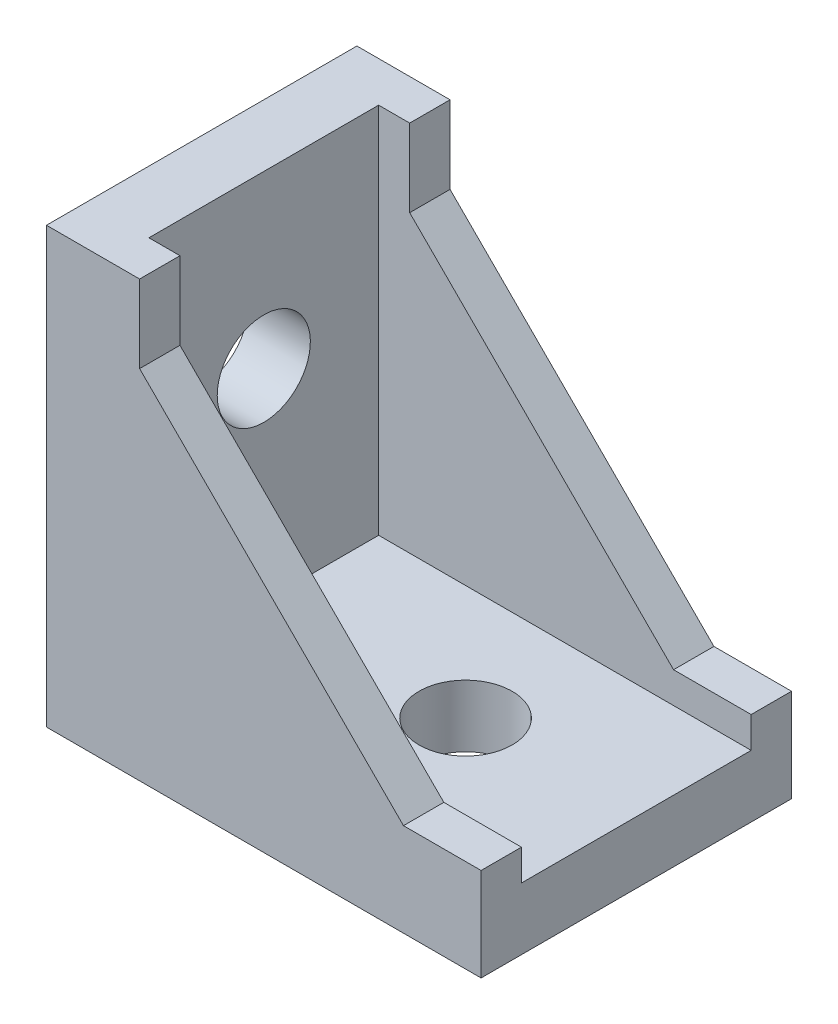
ISO-10303-21;
HEADER;
FILE_DESCRIPTION(('STEP AP214'),'2;1');
FILE_NAME('part.step','',(''),(''),'','','');
FILE_SCHEMA(('AUTOMOTIVE_DESIGN { 1 0 10303 214 1 1 1 1 }'));
ENDSEC;
DATA;
#1=APPLICATION_CONTEXT('core data for automotive mechanical design processes');
#2=APPLICATION_PROTOCOL_DEFINITION('international standard','automotive_design',2000,#1);
#3=PRODUCT_CONTEXT('',#1,'mechanical');
#4=PRODUCT('Part','Part','',(#3));
#5=PRODUCT_RELATED_PRODUCT_CATEGORY('part','',(#4));
#6=PRODUCT_DEFINITION_FORMATION('','',#4);
#7=PRODUCT_DEFINITION_CONTEXT('part definition',#1,'design');
#8=PRODUCT_DEFINITION('design','',#6,#7);
#9=PRODUCT_DEFINITION_SHAPE('','',#8);
#10=(LENGTH_UNIT() NAMED_UNIT(*) SI_UNIT(.MILLI.,.METRE.));
#11=(NAMED_UNIT(*) PLANE_ANGLE_UNIT() SI_UNIT($,.RADIAN.));
#12=(NAMED_UNIT(*) SI_UNIT($,.STERADIAN.) SOLID_ANGLE_UNIT());
#13=UNCERTAINTY_MEASURE_WITH_UNIT(LENGTH_MEASURE(1.E-05),#10,'distance_accuracy_value','');
#14=(GEOMETRIC_REPRESENTATION_CONTEXT(3) GLOBAL_UNCERTAINTY_ASSIGNED_CONTEXT((#13)) GLOBAL_UNIT_ASSIGNED_CONTEXT((#10,
#11,#12)) REPRESENTATION_CONTEXT('',''));
#15=CARTESIAN_POINT('',(0.,0.,0.));
#16=DIRECTION('',(0.,0.,1.));
#17=DIRECTION('',(1.,0.,0.));
#18=AXIS2_PLACEMENT_3D('',#15,#16,#17);
#19=CARTESIAN_POINT('',(0.,0.,20.));
#20=DIRECTION('',(1.,0.,0.));
#21=DIRECTION('',(0.,0.,-1.));
#22=AXIS2_PLACEMENT_3D('',#19,#20,#21);
#23=PLANE('',#22);
#24=CARTESIAN_POINT('',(0.,17.,10.));
#25=DIRECTION('',(-1.,0.,0.));
#26=DIRECTION('',(0.,0.,1.));
#27=AXIS2_PLACEMENT_3D('',#24,#25,#26);
#28=CIRCLE('',#27,3.);
#29=CARTESIAN_POINT('',(0.,17.,13.));
#30=VERTEX_POINT('',#29);
#31=EDGE_CURVE('E780',#30,#30,#28,.T.);
#32=ORIENTED_EDGE('',*,*,#31,.F.);
#33=EDGE_LOOP('',(#32));
#34=FACE_BOUND('',#33,.T.);
#35=DIRECTION('',(0.,-1.,0.));
#36=VECTOR('',#35,1.);
#37=CARTESIAN_POINT('',(0.,26.,7.));
#38=LINE('',#37,#36);
#39=CARTESIAN_POINT('',(0.,26.,7.));
#40=VERTEX_POINT('',#39);
#41=CARTESIAN_POINT('',(0.,24.,7.));
#42=VERTEX_POINT('',#41);
#43=EDGE_CURVE('E336',#40,#42,#38,.T.);
#44=ORIENTED_EDGE('',*,*,#43,.F.);
#45=DIRECTION('',(0.,0.,-1.));
#46=VECTOR('',#45,1.);
#47=CARTESIAN_POINT('',(0.,26.,13.));
#48=LINE('',#47,#46);
#49=CARTESIAN_POINT('',(0.,26.,13.));
#50=VERTEX_POINT('',#49);
#51=EDGE_CURVE('E341',#50,#40,#48,.T.);
#52=ORIENTED_EDGE('',*,*,#51,.F.);
#53=DIRECTION('',(0.,1.,0.));
#54=VECTOR('',#53,1.);
#55=CARTESIAN_POINT('',(0.,26.,13.));
#56=LINE('',#55,#54);
#57=CARTESIAN_POINT('',(0.,24.,13.));
#58=VERTEX_POINT('',#57);
#59=EDGE_CURVE('E353',#58,#50,#56,.T.);
#60=ORIENTED_EDGE('',*,*,#59,.F.);
#61=DIRECTION('',(0.,0.,1.));
#62=VECTOR('',#61,1.);
#63=CARTESIAN_POINT('',(0.,24.,13.));
#64=LINE('',#63,#62);
#65=EDGE_CURVE('E350',#42,#58,#64,.T.);
#66=ORIENTED_EDGE('',*,*,#65,.F.);
#67=EDGE_LOOP('',(#44,#52,#60,#66));
#68=FACE_BOUND('',#67,.T.);
#69=DIRECTION('',(0.,-1.,0.));
#70=VECTOR('',#69,1.);
#71=CARTESIAN_POINT('',(0.,0.,0.));
#72=LINE('',#71,#70);
#73=CARTESIAN_POINT('',(0.,28.,0.));
#74=VERTEX_POINT('',#73);
#75=CARTESIAN_POINT('',(0.,0.,0.));
#76=VERTEX_POINT('',#75);
#77=EDGE_CURVE('E450',#74,#76,#72,.T.);
#78=ORIENTED_EDGE('',*,*,#77,.T.);
#79=DIRECTION('',(0.,0.,-1.));
#80=VECTOR('',#79,1.);
#81=CARTESIAN_POINT('',(0.,0.,20.));
#82=LINE('',#81,#80);
#83=CARTESIAN_POINT('',(0.,0.,20.));
#84=VERTEX_POINT('',#83);
#85=EDGE_CURVE('E456',#84,#76,#82,.T.);
#86=ORIENTED_EDGE('',*,*,#85,.F.);
#87=DIRECTION('',(0.,-1.,0.));
#88=VECTOR('',#87,1.);
#89=CARTESIAN_POINT('',(0.,0.,20.));
#90=LINE('',#89,#88);
#91=CARTESIAN_POINT('',(0.,28.,20.));
#92=VERTEX_POINT('',#91);
#93=EDGE_CURVE('E454',#92,#84,#90,.T.);
#94=ORIENTED_EDGE('',*,*,#93,.F.);
#95=DIRECTION('',(0.,0.,-1.));
#96=VECTOR('',#95,1.);
#97=CARTESIAN_POINT('',(0.,28.,20.));
#98=LINE('',#97,#96);
#99=EDGE_CURVE('E466',#92,#74,#98,.T.);
#100=ORIENTED_EDGE('',*,*,#99,.T.);
#101=EDGE_LOOP('',(#78,#86,#94,#100));
#102=FACE_BOUND('',#101,.T.);
#103=DIRECTION('',(0.,0.,1.));
#104=VECTOR('',#103,1.);
#105=CARTESIAN_POINT('',(0.,2.,13.));
#106=LINE('',#105,#104);
#107=CARTESIAN_POINT('',(0.,2.,7.));
#108=VERTEX_POINT('',#107);
#109=CARTESIAN_POINT('',(0.,2.,13.));
#110=VERTEX_POINT('',#109);
#111=EDGE_CURVE('E303',#108,#110,#106,.T.);
#112=ORIENTED_EDGE('',*,*,#111,.F.);
#113=DIRECTION('',(0.,-1.,0.));
#114=VECTOR('',#113,1.);
#115=CARTESIAN_POINT('',(0.,2.,7.));
#116=LINE('',#115,#114);
#117=CARTESIAN_POINT('',(0.,4.,7.));
#118=VERTEX_POINT('',#117);
#119=EDGE_CURVE('E308',#118,#108,#116,.T.);
#120=ORIENTED_EDGE('',*,*,#119,.F.);
#121=DIRECTION('',(0.,0.,-1.));
#122=VECTOR('',#121,1.);
#123=CARTESIAN_POINT('',(0.,4.,13.));
#124=LINE('',#123,#122);
#125=CARTESIAN_POINT('',(0.,4.,13.));
#126=VERTEX_POINT('',#125);
#127=EDGE_CURVE('E320',#126,#118,#124,.T.);
#128=ORIENTED_EDGE('',*,*,#127,.F.);
#129=DIRECTION('',(0.,1.,0.));
#130=VECTOR('',#129,1.);
#131=CARTESIAN_POINT('',(0.,2.,13.));
#132=LINE('',#131,#130);
#133=EDGE_CURVE('E317',#110,#126,#132,.T.);
#134=ORIENTED_EDGE('',*,*,#133,.F.);
#135=EDGE_LOOP('',(#112,#120,#128,#134));
#136=FACE_BOUND('',#135,.T.);
#137=ADVANCED_FACE('F34',(#34,#68,#102,#136),#23,.F.);
#138=CARTESIAN_POINT('',(28.,4.00000000000012,20.));
#139=DIRECTION('',(0.,-1.,0.));
#140=DIRECTION('',(1.,0.,0.));
#141=AXIS2_PLACEMENT_3D('',#138,#139,#140);
#142=PLANE('',#141);
#143=CARTESIAN_POINT('',(17.,4.00000000000007,10.));
#144=DIRECTION('',(0.,-1.,0.));
#145=DIRECTION('',(1.,0.,0.));
#146=AXIS2_PLACEMENT_3D('',#143,#144,#145);
#147=CIRCLE('',#146,3.);
#148=CARTESIAN_POINT('',(20.,4.00000000000009,10.));
#149=VERTEX_POINT('',#148);
#150=EDGE_CURVE('E778',#149,#149,#147,.T.);
#151=ORIENTED_EDGE('',*,*,#150,.T.);
#152=EDGE_LOOP('',(#151));
#153=FACE_BOUND('',#152,.T.);
#154=DIRECTION('',(1.,0.,0.));
#155=VECTOR('',#154,1.);
#156=CARTESIAN_POINT('',(4.,4.00000000000002,2.6));
#157=LINE('',#156,#155);
#158=CARTESIAN_POINT('',(4.,4.00000000000002,2.6));
#159=VERTEX_POINT('',#158);
#160=CARTESIAN_POINT('',(28.,4.00000000000012,2.6));
#161=VERTEX_POINT('',#160);
#162=EDGE_CURVE('E385',#159,#161,#157,.T.);
#163=ORIENTED_EDGE('',*,*,#162,.F.);
#164=DIRECTION('',(0.,0.,-1.));
#165=VECTOR('',#164,1.);
#166=CARTESIAN_POINT('',(4.,4.00000000000002,20.));
#167=LINE('',#166,#165);
#168=CARTESIAN_POINT('',(4.,4.00000000000002,17.4));
#169=VERTEX_POINT('',#168);
#170=EDGE_CURVE('E472',#169,#159,#167,.T.);
#171=ORIENTED_EDGE('',*,*,#170,.F.);
#172=DIRECTION('',(1.,0.,0.));
#173=VECTOR('',#172,1.);
#174=CARTESIAN_POINT('',(4.,4.00000000000002,17.4));
#175=LINE('',#174,#173);
#176=CARTESIAN_POINT('',(28.,4.00000000000012,17.4));
#177=VERTEX_POINT('',#176);
#178=EDGE_CURVE('E409',#169,#177,#175,.T.);
#179=ORIENTED_EDGE('',*,*,#178,.T.);
#180=DIRECTION('',(0.,0.,-1.));
#181=VECTOR('',#180,1.);
#182=CARTESIAN_POINT('',(28.,4.00000000000012,20.));
#183=LINE('',#182,#181);
#184=EDGE_CURVE('E42',#177,#161,#183,.T.);
#185=ORIENTED_EDGE('',*,*,#184,.T.);
#186=EDGE_LOOP('',(#163,#171,#179,#185));
#187=FACE_BOUND('',#186,.T.);
#188=ADVANCED_FACE('F476',(#153,#187),#142,.F.);
#189=CARTESIAN_POINT('',(4.,28.,20.));
#190=DIRECTION('',(-1.,0.,0.));
#191=DIRECTION('',(0.,-1.,0.));
#192=AXIS2_PLACEMENT_3D('',#189,#190,#191);
#193=PLANE('',#192);
#194=CARTESIAN_POINT('',(4.,17.,10.));
#195=DIRECTION('',(-1.,0.,0.));
#196=DIRECTION('',(0.,-1.,0.));
#197=AXIS2_PLACEMENT_3D('',#194,#195,#196);
#198=CIRCLE('',#197,3.);
#199=CARTESIAN_POINT('',(4.,14.,10.));
#200=VERTEX_POINT('',#199);
#201=EDGE_CURVE('E265',#200,#200,#198,.F.);
#202=ORIENTED_EDGE('',*,*,#201,.F.);
#203=EDGE_LOOP('',(#202));
#204=FACE_BOUND('',#203,.T.);
#205=DIRECTION('',(0.,-1.,0.));
#206=VECTOR('',#205,1.);
#207=CARTESIAN_POINT('',(4.,28.,2.6));
#208=LINE('',#207,#206);
#209=CARTESIAN_POINT('',(4.,28.,2.6));
#210=VERTEX_POINT('',#209);
#211=EDGE_CURVE('E370',#210,#159,#208,.T.);
#212=ORIENTED_EDGE('',*,*,#211,.F.);
#213=DIRECTION('',(0.,0.,-1.));
#214=VECTOR('',#213,1.);
#215=CARTESIAN_POINT('',(4.,28.,20.));
#216=LINE('',#215,#214);
#217=CARTESIAN_POINT('',(4.,28.,17.4));
#218=VERTEX_POINT('',#217);
#219=EDGE_CURVE('E469',#218,#210,#216,.T.);
#220=ORIENTED_EDGE('',*,*,#219,.F.);
#221=DIRECTION('',(0.,-1.,0.));
#222=VECTOR('',#221,1.);
#223=CARTESIAN_POINT('',(4.,28.,17.4));
#224=LINE('',#223,#222);
#225=EDGE_CURVE('E406',#218,#169,#224,.T.);
#226=ORIENTED_EDGE('',*,*,#225,.T.);
#227=ORIENTED_EDGE('',*,*,#170,.T.);
#228=EDGE_LOOP('',(#212,#220,#226,#227));
#229=FACE_BOUND('',#228,.T.);
#230=ADVANCED_FACE('F505',(#204,#229),#193,.F.);
#231=CARTESIAN_POINT('',(0.,0.,20.));
#232=DIRECTION('',(0.,1.,0.));
#233=DIRECTION('',(-1.,0.,0.));
#234=AXIS2_PLACEMENT_3D('',#231,#232,#233);
#235=PLANE('',#234);
#236=CARTESIAN_POINT('',(17.,0.,10.));
#237=DIRECTION('',(0.,1.,0.));
#238=DIRECTION('',(0.,0.,1.));
#239=AXIS2_PLACEMENT_3D('',#236,#237,#238);
#240=CIRCLE('',#239,3.);
#241=CARTESIAN_POINT('',(17.,0.,13.));
#242=VERTEX_POINT('',#241);
#243=EDGE_CURVE('E620',#242,#242,#240,.T.);
#244=ORIENTED_EDGE('',*,*,#243,.T.);
#245=EDGE_LOOP('',(#244));
#246=FACE_BOUND('',#245,.T.);
#247=DIRECTION('',(-1.,0.,0.));
#248=VECTOR('',#247,1.);
#249=CARTESIAN_POINT('',(2.,0.,7.));
#250=LINE('',#249,#248);
#251=CARTESIAN_POINT('',(4.,0.,7.));
#252=VERTEX_POINT('',#251);
#253=CARTESIAN_POINT('',(2.,0.,7.));
#254=VERTEX_POINT('',#253);
#255=EDGE_CURVE('E264',#252,#254,#250,.T.);
#256=ORIENTED_EDGE('',*,*,#255,.T.);
#257=DIRECTION('',(0.,0.,1.));
#258=VECTOR('',#257,1.);
#259=CARTESIAN_POINT('',(2.,0.,13.));
#260=LINE('',#259,#258);
#261=CARTESIAN_POINT('',(2.,0.,13.));
#262=VERTEX_POINT('',#261);
#263=EDGE_CURVE('E237',#254,#262,#260,.T.);
#264=ORIENTED_EDGE('',*,*,#263,.T.);
#265=DIRECTION('',(1.,0.,0.));
#266=VECTOR('',#265,1.);
#267=CARTESIAN_POINT('',(2.,0.,13.));
#268=LINE('',#267,#266);
#269=CARTESIAN_POINT('',(4.00000000000001,0.,13.));
#270=VERTEX_POINT('',#269);
#271=EDGE_CURVE('E253',#262,#270,#268,.T.);
#272=ORIENTED_EDGE('',*,*,#271,.T.);
#273=DIRECTION('',(0.,0.,-1.));
#274=VECTOR('',#273,1.);
#275=CARTESIAN_POINT('',(4.,0.,13.));
#276=LINE('',#275,#274);
#277=EDGE_CURVE('E49',#270,#252,#276,.T.);
#278=ORIENTED_EDGE('',*,*,#277,.T.);
#279=EDGE_LOOP('',(#256,#264,#272,#278));
#280=FACE_BOUND('',#279,.T.);
#281=DIRECTION('',(0.,0.,-1.));
#282=VECTOR('',#281,1.);
#283=CARTESIAN_POINT('',(26.,1.09690034832965E-13,13.));
#284=LINE('',#283,#282);
#285=CARTESIAN_POINT('',(26.,1.09690034832965E-13,13.));
#286=VERTEX_POINT('',#285);
#287=CARTESIAN_POINT('',(26.,1.09690034832965E-13,7.));
#288=VERTEX_POINT('',#287);
#289=EDGE_CURVE('E290',#286,#288,#284,.T.);
#290=ORIENTED_EDGE('',*,*,#289,.T.);
#291=DIRECTION('',(-1.,0.,0.));
#292=VECTOR('',#291,1.);
#293=CARTESIAN_POINT('',(26.,1.09690034832965E-13,7.));
#294=LINE('',#293,#292);
#295=CARTESIAN_POINT('',(24.,1.01252339845814E-13,7.));
#296=VERTEX_POINT('',#295);
#297=EDGE_CURVE('E242',#288,#296,#294,.T.);
#298=ORIENTED_EDGE('',*,*,#297,.T.);
#299=DIRECTION('',(0.,0.,1.));
#300=VECTOR('',#299,1.);
#301=CARTESIAN_POINT('',(24.,1.01252339845814E-13,13.));
#302=LINE('',#301,#300);
#303=CARTESIAN_POINT('',(24.,1.01109596885505E-13,13.));
#304=VERTEX_POINT('',#303);
#305=EDGE_CURVE('E278',#296,#304,#302,.T.);
#306=ORIENTED_EDGE('',*,*,#305,.T.);
#307=DIRECTION('',(1.,0.,0.));
#308=VECTOR('',#307,1.);
#309=CARTESIAN_POINT('',(26.,1.09690034832965E-13,13.));
#310=LINE('',#309,#308);
#311=EDGE_CURVE('E57',#304,#286,#310,.T.);
#312=ORIENTED_EDGE('',*,*,#311,.T.);
#313=EDGE_LOOP('',(#290,#298,#306,#312));
#314=FACE_BOUND('',#313,.T.);
#315=DIRECTION('',(1.,0.,0.));
#316=VECTOR('',#315,1.);
#317=CARTESIAN_POINT('',(0.,0.,0.));
#318=LINE('',#317,#316);
#319=CARTESIAN_POINT('',(28.,1.17961196366423E-13,0.));
#320=VERTEX_POINT('',#319);
#321=EDGE_CURVE('E439',#76,#320,#318,.T.);
#322=ORIENTED_EDGE('',*,*,#321,.T.);
#323=DIRECTION('',(0.,0.,-1.));
#324=VECTOR('',#323,1.);
#325=CARTESIAN_POINT('',(28.,1.17961196366423E-13,20.));
#326=LINE('',#325,#324);
#327=CARTESIAN_POINT('',(28.,1.17961196366423E-13,20.));
#328=VERTEX_POINT('',#327);
#329=EDGE_CURVE('E11',#328,#320,#326,.T.);
#330=ORIENTED_EDGE('',*,*,#329,.F.);
#331=DIRECTION('',(1.,0.,0.));
#332=VECTOR('',#331,1.);
#333=CARTESIAN_POINT('',(0.,0.,20.));
#334=LINE('',#333,#332);
#335=EDGE_CURVE('E446',#84,#328,#334,.T.);
#336=ORIENTED_EDGE('',*,*,#335,.F.);
#337=ORIENTED_EDGE('',*,*,#85,.T.);
#338=EDGE_LOOP('',(#322,#330,#336,#337));
#339=FACE_BOUND('',#338,.T.);
#340=ADVANCED_FACE('F36',(#246,#280,#314,#339),#235,.F.);
#341=CARTESIAN_POINT('',(28.,1.17961196366423E-13,20.));
#342=DIRECTION('',(-1.,0.,0.));
#343=DIRECTION('',(0.,-1.,0.));
#344=AXIS2_PLACEMENT_3D('',#341,#342,#343);
#345=PLANE('',#344);
#346=DIRECTION('',(0.,1.,0.));
#347=VECTOR('',#346,1.);
#348=CARTESIAN_POINT('',(28.,1.17961196366423E-13,0.));
#349=LINE('',#348,#347);
#350=CARTESIAN_POINT('',(28.,6.00000000000012,0.));
#351=VERTEX_POINT('',#350);
#352=EDGE_CURVE('E459',#320,#351,#349,.T.);
#353=ORIENTED_EDGE('',*,*,#352,.T.);
#354=DIRECTION('',(0.,0.,-1.));
#355=VECTOR('',#354,1.);
#356=CARTESIAN_POINT('',(28.,6.00000000000012,2.6));
#357=LINE('',#356,#355);
#358=CARTESIAN_POINT('',(28.,6.00000000000012,2.6));
#359=VERTEX_POINT('',#358);
#360=EDGE_CURVE('E394',#359,#351,#357,.T.);
#361=ORIENTED_EDGE('',*,*,#360,.F.);
#362=DIRECTION('',(0.,1.,0.));
#363=VECTOR('',#362,1.);
#364=CARTESIAN_POINT('',(28.,4.00000000000012,2.6));
#365=LINE('',#364,#363);
#366=EDGE_CURVE('E383',#161,#359,#365,.T.);
#367=ORIENTED_EDGE('',*,*,#366,.F.);
#368=ORIENTED_EDGE('',*,*,#184,.F.);
#369=DIRECTION('',(0.,1.,0.));
#370=VECTOR('',#369,1.);
#371=CARTESIAN_POINT('',(28.,4.00000000000012,17.4));
#372=LINE('',#371,#370);
#373=CARTESIAN_POINT('',(28.,6.00000000000012,17.4));
#374=VERTEX_POINT('',#373);
#375=EDGE_CURVE('E413',#177,#374,#372,.T.);
#376=ORIENTED_EDGE('',*,*,#375,.T.);
#377=DIRECTION('',(0.,0.,1.));
#378=VECTOR('',#377,1.);
#379=CARTESIAN_POINT('',(28.,6.00000000000012,17.4));
#380=LINE('',#379,#378);
#381=CARTESIAN_POINT('',(28.,6.00000000000012,20.));
#382=VERTEX_POINT('',#381);
#383=EDGE_CURVE('E428',#374,#382,#380,.T.);
#384=ORIENTED_EDGE('',*,*,#383,.T.);
#385=DIRECTION('',(0.,1.,0.));
#386=VECTOR('',#385,1.);
#387=CARTESIAN_POINT('',(28.,1.17961196366423E-13,20.));
#388=LINE('',#387,#386);
#389=EDGE_CURVE('E449',#328,#382,#388,.T.);
#390=ORIENTED_EDGE('',*,*,#389,.F.);
#391=ORIENTED_EDGE('',*,*,#329,.T.);
#392=EDGE_LOOP('',(#353,#361,#367,#368,#376,#384,#390,#391));
#393=FACE_BOUND('',#392,.T.);
#394=ADVANCED_FACE('F483',(#393),#345,.F.);
#395=CARTESIAN_POINT('',(0.,28.,20.));
#396=DIRECTION('',(0.,-1.,0.));
#397=DIRECTION('',(0.,0.,-1.));
#398=AXIS2_PLACEMENT_3D('',#395,#396,#397);
#399=PLANE('',#398);
#400=DIRECTION('',(-1.,0.,0.));
#401=VECTOR('',#400,1.);
#402=CARTESIAN_POINT('',(0.,28.,0.));
#403=LINE('',#402,#401);
#404=CARTESIAN_POINT('',(6.,28.,0.));
#405=VERTEX_POINT('',#404);
#406=EDGE_CURVE('E461',#405,#74,#403,.T.);
#407=ORIENTED_EDGE('',*,*,#406,.T.);
#408=ORIENTED_EDGE('',*,*,#99,.F.);
#409=DIRECTION('',(-1.,0.,0.));
#410=VECTOR('',#409,1.);
#411=CARTESIAN_POINT('',(0.,28.,20.));
#412=LINE('',#411,#410);
#413=CARTESIAN_POINT('',(6.,28.,20.));
#414=VERTEX_POINT('',#413);
#415=EDGE_CURVE('E452',#414,#92,#412,.T.);
#416=ORIENTED_EDGE('',*,*,#415,.F.);
#417=DIRECTION('',(0.,0.,1.));
#418=VECTOR('',#417,1.);
#419=CARTESIAN_POINT('',(6.,28.,17.4));
#420=LINE('',#419,#418);
#421=CARTESIAN_POINT('',(6.,28.,17.4));
#422=VERTEX_POINT('',#421);
#423=EDGE_CURVE('E436',#422,#414,#420,.T.);
#424=ORIENTED_EDGE('',*,*,#423,.F.);
#425=DIRECTION('',(-1.,0.,0.));
#426=VECTOR('',#425,1.);
#427=CARTESIAN_POINT('',(4.,28.,17.4));
#428=LINE('',#427,#426);
#429=EDGE_CURVE('E425',#422,#218,#428,.T.);
#430=ORIENTED_EDGE('',*,*,#429,.T.);
#431=ORIENTED_EDGE('',*,*,#219,.T.);
#432=DIRECTION('',(-1.,0.,0.));
#433=VECTOR('',#432,1.);
#434=CARTESIAN_POINT('',(4.,28.,2.6));
#435=LINE('',#434,#433);
#436=CARTESIAN_POINT('',(6.,28.,2.6));
#437=VERTEX_POINT('',#436);
#438=EDGE_CURVE('E373',#437,#210,#435,.T.);
#439=ORIENTED_EDGE('',*,*,#438,.F.);
#440=DIRECTION('',(0.,0.,-1.));
#441=VECTOR('',#440,1.);
#442=CARTESIAN_POINT('',(6.,28.,2.6));
#443=LINE('',#442,#441);
#444=EDGE_CURVE('E388',#437,#405,#443,.T.);
#445=ORIENTED_EDGE('',*,*,#444,.T.);
#446=EDGE_LOOP('',(#407,#408,#416,#424,#430,#431,#439,#445));
#447=FACE_BOUND('',#446,.T.);
#448=ADVANCED_FACE('F501',(#447),#399,.F.);
#449=CARTESIAN_POINT('',(0.,0.,20.));
#450=DIRECTION('',(0.,0.,1.));
#451=DIRECTION('',(1.,0.,0.));
#452=AXIS2_PLACEMENT_3D('',#449,#450,#451);
#453=PLANE('',#452);
#454=DIRECTION('',(0.,1.,0.));
#455=VECTOR('',#454,1.);
#456=CARTESIAN_POINT('',(6.,28.,20.));
#457=LINE('',#456,#455);
#458=CARTESIAN_POINT('',(6.,23.,20.));
#459=VERTEX_POINT('',#458);
#460=EDGE_CURVE('E410',#459,#414,#457,.T.);
#461=ORIENTED_EDGE('',*,*,#460,.T.);
#462=ORIENTED_EDGE('',*,*,#415,.T.);
#463=ORIENTED_EDGE('',*,*,#93,.T.);
#464=ORIENTED_EDGE('',*,*,#335,.T.);
#465=ORIENTED_EDGE('',*,*,#389,.T.);
#466=DIRECTION('',(-1.,0.,0.));
#467=VECTOR('',#466,1.);
#468=CARTESIAN_POINT('',(28.,6.00000000000012,20.));
#469=LINE('',#468,#467);
#470=CARTESIAN_POINT('',(23.,6.00000000000012,20.));
#471=VERTEX_POINT('',#470);
#472=EDGE_CURVE('E397',#382,#471,#469,.T.);
#473=ORIENTED_EDGE('',*,*,#472,.T.);
#474=DIRECTION('',(-0.707106781186549,0.707106781186546,0.));
#475=VECTOR('',#474,1.);
#476=CARTESIAN_POINT('',(6.,23.,20.));
#477=LINE('',#476,#475);
#478=EDGE_CURVE('E431',#471,#459,#477,.T.);
#479=ORIENTED_EDGE('',*,*,#478,.T.);
#480=EDGE_LOOP('',(#461,#462,#463,#464,#465,#473,#479));
#481=FACE_BOUND('',#480,.T.);
#482=ADVANCED_FACE('F516',(#481),#453,.T.);
#483=CARTESIAN_POINT('',(0.,0.,0.));
#484=DIRECTION('',(0.,0.,1.));
#485=DIRECTION('',(1.,0.,0.));
#486=AXIS2_PLACEMENT_3D('',#483,#484,#485);
#487=PLANE('',#486);
#488=ORIENTED_EDGE('',*,*,#406,.F.);
#489=DIRECTION('',(0.,1.,0.));
#490=VECTOR('',#489,1.);
#491=CARTESIAN_POINT('',(6.,28.,0.));
#492=LINE('',#491,#490);
#493=CARTESIAN_POINT('',(6.,23.,0.));
#494=VERTEX_POINT('',#493);
#495=EDGE_CURVE('E369',#494,#405,#492,.T.);
#496=ORIENTED_EDGE('',*,*,#495,.F.);
#497=DIRECTION('',(-0.707106781186549,0.707106781186546,0.));
#498=VECTOR('',#497,1.);
#499=CARTESIAN_POINT('',(6.,23.,0.));
#500=LINE('',#499,#498);
#501=CARTESIAN_POINT('',(23.,6.00000000000012,0.));
#502=VERTEX_POINT('',#501);
#503=EDGE_CURVE('E391',#502,#494,#500,.T.);
#504=ORIENTED_EDGE('',*,*,#503,.F.);
#505=DIRECTION('',(-1.,0.,0.));
#506=VECTOR('',#505,1.);
#507=CARTESIAN_POINT('',(28.,6.00000000000012,0.));
#508=LINE('',#507,#506);
#509=EDGE_CURVE('E374',#351,#502,#508,.T.);
#510=ORIENTED_EDGE('',*,*,#509,.F.);
#511=ORIENTED_EDGE('',*,*,#352,.F.);
#512=ORIENTED_EDGE('',*,*,#321,.F.);
#513=ORIENTED_EDGE('',*,*,#77,.F.);
#514=EDGE_LOOP('',(#488,#496,#504,#510,#511,#512,#513));
#515=FACE_BOUND('',#514,.T.);
#516=ADVANCED_FACE('F525',(#515),#487,.F.);
#517=CARTESIAN_POINT('',(6.,28.,17.4));
#518=DIRECTION('',(1.,0.,0.));
#519=DIRECTION('',(0.,1.,0.));
#520=AXIS2_PLACEMENT_3D('',#517,#518,#519);
#521=PLANE('',#520);
#522=ORIENTED_EDGE('',*,*,#460,.F.);
#523=DIRECTION('',(0.,0.,1.));
#524=VECTOR('',#523,1.);
#525=CARTESIAN_POINT('',(6.,23.,17.4));
#526=LINE('',#525,#524);
#527=CARTESIAN_POINT('',(6.,23.,17.4));
#528=VERTEX_POINT('',#527);
#529=EDGE_CURVE('E440',#528,#459,#526,.T.);
#530=ORIENTED_EDGE('',*,*,#529,.F.);
#531=DIRECTION('',(0.,1.,0.));
#532=VECTOR('',#531,1.);
#533=CARTESIAN_POINT('',(6.,28.,17.4));
#534=LINE('',#533,#532);
#535=EDGE_CURVE('E422',#528,#422,#534,.T.);
#536=ORIENTED_EDGE('',*,*,#535,.T.);
#537=ORIENTED_EDGE('',*,*,#423,.T.);
#538=EDGE_LOOP('',(#522,#530,#536,#537));
#539=FACE_BOUND('',#538,.T.);
#540=ADVANCED_FACE('F589',(#539),#521,.T.);
#541=CARTESIAN_POINT('',(6.,23.,17.4));
#542=DIRECTION('',(0.707106781186546,0.707106781186549,0.));
#543=DIRECTION('',(-0.707106781186549,0.707106781186546,0.));
#544=AXIS2_PLACEMENT_3D('',#541,#542,#543);
#545=PLANE('',#544);
#546=ORIENTED_EDGE('',*,*,#478,.F.);
#547=DIRECTION('',(0.,0.,1.));
#548=VECTOR('',#547,1.);
#549=CARTESIAN_POINT('',(23.,6.00000000000012,17.4));
#550=LINE('',#549,#548);
#551=CARTESIAN_POINT('',(23.,6.00000000000012,17.4));
#552=VERTEX_POINT('',#551);
#553=EDGE_CURVE('E442',#552,#471,#550,.T.);
#554=ORIENTED_EDGE('',*,*,#553,.F.);
#555=DIRECTION('',(-0.707106781186549,0.707106781186546,0.));
#556=VECTOR('',#555,1.);
#557=CARTESIAN_POINT('',(6.,23.,17.4));
#558=LINE('',#557,#556);
#559=EDGE_CURVE('E419',#552,#528,#558,.T.);
#560=ORIENTED_EDGE('',*,*,#559,.T.);
#561=ORIENTED_EDGE('',*,*,#529,.T.);
#562=EDGE_LOOP('',(#546,#554,#560,#561));
#563=FACE_BOUND('',#562,.T.);
#564=ADVANCED_FACE('F592',(#563),#545,.T.);
#565=CARTESIAN_POINT('',(28.,6.00000000000012,17.4));
#566=DIRECTION('',(0.,1.,0.));
#567=DIRECTION('',(-1.,0.,0.));
#568=AXIS2_PLACEMENT_3D('',#565,#566,#567);
#569=PLANE('',#568);
#570=ORIENTED_EDGE('',*,*,#472,.F.);
#571=ORIENTED_EDGE('',*,*,#383,.F.);
#572=DIRECTION('',(-1.,0.,0.));
#573=VECTOR('',#572,1.);
#574=CARTESIAN_POINT('',(28.,6.00000000000012,17.4));
#575=LINE('',#574,#573);
#576=EDGE_CURVE('E416',#374,#552,#575,.T.);
#577=ORIENTED_EDGE('',*,*,#576,.T.);
#578=ORIENTED_EDGE('',*,*,#553,.T.);
#579=EDGE_LOOP('',(#570,#571,#577,#578));
#580=FACE_BOUND('',#579,.T.);
#581=ADVANCED_FACE('F513',(#580),#569,.T.);
#582=CARTESIAN_POINT('',(0.,0.,17.4));
#583=DIRECTION('',(0.,0.,1.));
#584=DIRECTION('',(1.,0.,0.));
#585=AXIS2_PLACEMENT_3D('',#582,#583,#584);
#586=PLANE('',#585);
#587=ORIENTED_EDGE('',*,*,#225,.F.);
#588=ORIENTED_EDGE('',*,*,#429,.F.);
#589=ORIENTED_EDGE('',*,*,#535,.F.);
#590=ORIENTED_EDGE('',*,*,#559,.F.);
#591=ORIENTED_EDGE('',*,*,#576,.F.);
#592=ORIENTED_EDGE('',*,*,#375,.F.);
#593=ORIENTED_EDGE('',*,*,#178,.F.);
#594=EDGE_LOOP('',(#587,#588,#589,#590,#591,#592,#593));
#595=FACE_BOUND('',#594,.T.);
#596=ADVANCED_FACE('F507',(#595),#586,.F.);
#597=CARTESIAN_POINT('',(28.,6.00000000000012,2.6));
#598=DIRECTION('',(0.,-1.,0.));
#599=DIRECTION('',(1.,0.,0.));
#600=AXIS2_PLACEMENT_3D('',#597,#598,#599);
#601=PLANE('',#600);
#602=ORIENTED_EDGE('',*,*,#509,.T.);
#603=DIRECTION('',(0.,0.,-1.));
#604=VECTOR('',#603,1.);
#605=CARTESIAN_POINT('',(23.,6.00000000000012,2.6));
#606=LINE('',#605,#604);
#607=CARTESIAN_POINT('',(23.,6.00000000000012,2.6));
#608=VERTEX_POINT('',#607);
#609=EDGE_CURVE('E398',#608,#502,#606,.T.);
#610=ORIENTED_EDGE('',*,*,#609,.F.);
#611=DIRECTION('',(-1.,0.,0.));
#612=VECTOR('',#611,1.);
#613=CARTESIAN_POINT('',(28.,6.00000000000012,2.6));
#614=LINE('',#613,#612);
#615=EDGE_CURVE('E381',#359,#608,#614,.T.);
#616=ORIENTED_EDGE('',*,*,#615,.F.);
#617=ORIENTED_EDGE('',*,*,#360,.T.);
#618=EDGE_LOOP('',(#602,#610,#616,#617));
#619=FACE_BOUND('',#618,.T.);
#620=ADVANCED_FACE('F488',(#619),#601,.F.);
#621=CARTESIAN_POINT('',(6.,23.,2.6));
#622=DIRECTION('',(-0.707106781186546,-0.707106781186549,0.));
#623=DIRECTION('',(0.707106781186549,-0.707106781186546,0.));
#624=AXIS2_PLACEMENT_3D('',#621,#622,#623);
#625=PLANE('',#624);
#626=ORIENTED_EDGE('',*,*,#503,.T.);
#627=DIRECTION('',(0.,0.,-1.));
#628=VECTOR('',#627,1.);
#629=CARTESIAN_POINT('',(6.,23.,2.6));
#630=LINE('',#629,#628);
#631=CARTESIAN_POINT('',(6.,23.,2.6));
#632=VERTEX_POINT('',#631);
#633=EDGE_CURVE('E401',#632,#494,#630,.T.);
#634=ORIENTED_EDGE('',*,*,#633,.F.);
#635=DIRECTION('',(-0.707106781186549,0.707106781186546,0.));
#636=VECTOR('',#635,1.);
#637=CARTESIAN_POINT('',(6.,23.,2.6));
#638=LINE('',#637,#636);
#639=EDGE_CURVE('E379',#608,#632,#638,.T.);
#640=ORIENTED_EDGE('',*,*,#639,.F.);
#641=ORIENTED_EDGE('',*,*,#609,.T.);
#642=EDGE_LOOP('',(#626,#634,#640,#641));
#643=FACE_BOUND('',#642,.T.);
#644=ADVANCED_FACE('F494',(#643),#625,.F.);
#645=CARTESIAN_POINT('',(6.,28.,2.6));
#646=DIRECTION('',(-1.,0.,0.));
#647=DIRECTION('',(0.,-1.,0.));
#648=AXIS2_PLACEMENT_3D('',#645,#646,#647);
#649=PLANE('',#648);
#650=ORIENTED_EDGE('',*,*,#495,.T.);
#651=ORIENTED_EDGE('',*,*,#444,.F.);
#652=DIRECTION('',(0.,1.,0.));
#653=VECTOR('',#652,1.);
#654=CARTESIAN_POINT('',(6.,28.,2.6));
#655=LINE('',#654,#653);
#656=EDGE_CURVE('E377',#632,#437,#655,.T.);
#657=ORIENTED_EDGE('',*,*,#656,.F.);
#658=ORIENTED_EDGE('',*,*,#633,.T.);
#659=EDGE_LOOP('',(#650,#651,#657,#658));
#660=FACE_BOUND('',#659,.T.);
#661=ADVANCED_FACE('F498',(#660),#649,.F.);
#662=CARTESIAN_POINT('',(0.,0.,2.6));
#663=DIRECTION('',(0.,0.,-1.));
#664=DIRECTION('',(1.,0.,0.));
#665=AXIS2_PLACEMENT_3D('',#662,#663,#664);
#666=PLANE('',#665);
#667=ORIENTED_EDGE('',*,*,#211,.T.);
#668=ORIENTED_EDGE('',*,*,#162,.T.);
#669=ORIENTED_EDGE('',*,*,#366,.T.);
#670=ORIENTED_EDGE('',*,*,#615,.T.);
#671=ORIENTED_EDGE('',*,*,#639,.T.);
#672=ORIENTED_EDGE('',*,*,#656,.T.);
#673=ORIENTED_EDGE('',*,*,#438,.T.);
#674=EDGE_LOOP('',(#667,#668,#669,#670,#671,#672,#673));
#675=FACE_BOUND('',#674,.T.);
#676=ADVANCED_FACE('F481',(#675),#666,.F.);
#677=CARTESIAN_POINT('',(-1.5,26.,7.));
#678=DIRECTION('',(0.,0.,1.));
#679=DIRECTION('',(1.,0.,0.));
#680=AXIS2_PLACEMENT_3D('',#677,#678,#679);
#681=PLANE('',#680);
#682=ORIENTED_EDGE('',*,*,#43,.T.);
#683=DIRECTION('',(1.,0.,0.));
#684=VECTOR('',#683,1.);
#685=CARTESIAN_POINT('',(-1.5,24.,7.));
#686=LINE('',#685,#684);
#687=CARTESIAN_POINT('',(-1.5,24.,7.));
#688=VERTEX_POINT('',#687);
#689=EDGE_CURVE('E366',#688,#42,#686,.T.);
#690=ORIENTED_EDGE('',*,*,#689,.F.);
#691=DIRECTION('',(0.,-1.,0.));
#692=VECTOR('',#691,1.);
#693=CARTESIAN_POINT('',(-1.5,26.,7.));
#694=LINE('',#693,#692);
#695=CARTESIAN_POINT('',(-1.5,26.,7.));
#696=VERTEX_POINT('',#695);
#697=EDGE_CURVE('E337',#696,#688,#694,.T.);
#698=ORIENTED_EDGE('',*,*,#697,.F.);
#699=DIRECTION('',(1.,0.,0.));
#700=VECTOR('',#699,1.);
#701=CARTESIAN_POINT('',(-1.5,26.,7.));
#702=LINE('',#701,#700);
#703=EDGE_CURVE('E347',#696,#40,#702,.T.);
#704=ORIENTED_EDGE('',*,*,#703,.T.);
#705=EDGE_LOOP('',(#682,#690,#698,#704));
#706=FACE_BOUND('',#705,.T.);
#707=ADVANCED_FACE('F574',(#706),#681,.F.);
#708=CARTESIAN_POINT('',(-1.5,24.,13.));
#709=DIRECTION('',(0.,1.,0.));
#710=DIRECTION('',(0.,0.,1.));
#711=AXIS2_PLACEMENT_3D('',#708,#709,#710);
#712=PLANE('',#711);
#713=ORIENTED_EDGE('',*,*,#65,.T.);
#714=DIRECTION('',(1.,0.,0.));
#715=VECTOR('',#714,1.);
#716=CARTESIAN_POINT('',(-1.5,24.,13.));
#717=LINE('',#716,#715);
#718=CARTESIAN_POINT('',(-1.5,24.,13.));
#719=VERTEX_POINT('',#718);
#720=EDGE_CURVE('E363',#719,#58,#717,.T.);
#721=ORIENTED_EDGE('',*,*,#720,.F.);
#722=DIRECTION('',(0.,0.,1.));
#723=VECTOR('',#722,1.);
#724=CARTESIAN_POINT('',(-1.5,24.,13.));
#725=LINE('',#724,#723);
#726=EDGE_CURVE('E340',#688,#719,#725,.T.);
#727=ORIENTED_EDGE('',*,*,#726,.F.);
#728=ORIENTED_EDGE('',*,*,#689,.T.);
#729=EDGE_LOOP('',(#713,#721,#727,#728));
#730=FACE_BOUND('',#729,.T.);
#731=ADVANCED_FACE('F570',(#730),#712,.F.);
#732=CARTESIAN_POINT('',(-1.5,26.,13.));
#733=DIRECTION('',(0.,0.,-1.));
#734=DIRECTION('',(-1.,0.,0.));
#735=AXIS2_PLACEMENT_3D('',#732,#733,#734);
#736=PLANE('',#735);
#737=ORIENTED_EDGE('',*,*,#59,.T.);
#738=DIRECTION('',(1.,0.,0.));
#739=VECTOR('',#738,1.);
#740=CARTESIAN_POINT('',(-1.5,26.,13.));
#741=LINE('',#740,#739);
#742=CARTESIAN_POINT('',(-1.5,26.,13.));
#743=VERTEX_POINT('',#742);
#744=EDGE_CURVE('E360',#743,#50,#741,.T.);
#745=ORIENTED_EDGE('',*,*,#744,.F.);
#746=DIRECTION('',(0.,1.,0.));
#747=VECTOR('',#746,1.);
#748=CARTESIAN_POINT('',(-1.5,26.,13.));
#749=LINE('',#748,#747);
#750=EDGE_CURVE('E343',#719,#743,#749,.T.);
#751=ORIENTED_EDGE('',*,*,#750,.F.);
#752=ORIENTED_EDGE('',*,*,#720,.T.);
#753=EDGE_LOOP('',(#737,#745,#751,#752));
#754=FACE_BOUND('',#753,.T.);
#755=ADVANCED_FACE('F566',(#754),#736,.F.);
#756=CARTESIAN_POINT('',(-1.5,26.,13.));
#757=DIRECTION('',(0.,-1.,0.));
#758=DIRECTION('',(0.,0.,-1.));
#759=AXIS2_PLACEMENT_3D('',#756,#757,#758);
#760=PLANE('',#759);
#761=ORIENTED_EDGE('',*,*,#51,.T.);
#762=ORIENTED_EDGE('',*,*,#703,.F.);
#763=DIRECTION('',(0.,0.,-1.));
#764=VECTOR('',#763,1.);
#765=CARTESIAN_POINT('',(-1.5,26.,13.));
#766=LINE('',#765,#764);
#767=EDGE_CURVE('E345',#743,#696,#766,.T.);
#768=ORIENTED_EDGE('',*,*,#767,.F.);
#769=ORIENTED_EDGE('',*,*,#744,.T.);
#770=EDGE_LOOP('',(#761,#762,#768,#769));
#771=FACE_BOUND('',#770,.T.);
#772=ADVANCED_FACE('F562',(#771),#760,.F.);
#773=CARTESIAN_POINT('',(-1.5,0.,0.));
#774=DIRECTION('',(1.,0.,0.));
#775=DIRECTION('',(0.,0.,-1.));
#776=AXIS2_PLACEMENT_3D('',#773,#774,#775);
#777=PLANE('',#776);
#778=ORIENTED_EDGE('',*,*,#697,.T.);
#779=ORIENTED_EDGE('',*,*,#726,.T.);
#780=ORIENTED_EDGE('',*,*,#750,.T.);
#781=ORIENTED_EDGE('',*,*,#767,.T.);
#782=EDGE_LOOP('',(#778,#779,#780,#781));
#783=FACE_BOUND('',#782,.T.);
#784=ADVANCED_FACE('F556',(#783),#777,.F.);
#785=CARTESIAN_POINT('',(-1.5,2.,13.));
#786=DIRECTION('',(0.,1.,0.));
#787=DIRECTION('',(0.,0.,1.));
#788=AXIS2_PLACEMENT_3D('',#785,#786,#787);
#789=PLANE('',#788);
#790=ORIENTED_EDGE('',*,*,#111,.T.);
#791=DIRECTION('',(1.,0.,0.));
#792=VECTOR('',#791,1.);
#793=CARTESIAN_POINT('',(-1.5,2.,13.));
#794=LINE('',#793,#792);
#795=CARTESIAN_POINT('',(-1.5,2.,13.));
#796=VERTEX_POINT('',#795);
#797=EDGE_CURVE('E333',#796,#110,#794,.T.);
#798=ORIENTED_EDGE('',*,*,#797,.F.);
#799=DIRECTION('',(0.,0.,1.));
#800=VECTOR('',#799,1.);
#801=CARTESIAN_POINT('',(-1.5,2.,13.));
#802=LINE('',#801,#800);
#803=CARTESIAN_POINT('',(-1.5,2.,7.));
#804=VERTEX_POINT('',#803);
#805=EDGE_CURVE('E304',#804,#796,#802,.T.);
#806=ORIENTED_EDGE('',*,*,#805,.F.);
#807=DIRECTION('',(1.,0.,0.));
#808=VECTOR('',#807,1.);
#809=CARTESIAN_POINT('',(-1.5,2.,7.));
#810=LINE('',#809,#808);
#811=EDGE_CURVE('E314',#804,#108,#810,.T.);
#812=ORIENTED_EDGE('',*,*,#811,.T.);
#813=EDGE_LOOP('',(#790,#798,#806,#812));
#814=FACE_BOUND('',#813,.T.);
#815=ADVANCED_FACE('F540',(#814),#789,.F.);
#816=CARTESIAN_POINT('',(-1.5,2.,13.));
#817=DIRECTION('',(0.,0.,-1.));
#818=DIRECTION('',(-1.,0.,0.));
#819=AXIS2_PLACEMENT_3D('',#816,#817,#818);
#820=PLANE('',#819);
#821=ORIENTED_EDGE('',*,*,#133,.T.);
#822=DIRECTION('',(1.,0.,0.));
#823=VECTOR('',#822,1.);
#824=CARTESIAN_POINT('',(-1.5,4.,13.));
#825=LINE('',#824,#823);
#826=CARTESIAN_POINT('',(-1.5,4.,13.));
#827=VERTEX_POINT('',#826);
#828=EDGE_CURVE('E330',#827,#126,#825,.T.);
#829=ORIENTED_EDGE('',*,*,#828,.F.);
#830=DIRECTION('',(0.,1.,0.));
#831=VECTOR('',#830,1.);
#832=CARTESIAN_POINT('',(-1.5,2.,13.));
#833=LINE('',#832,#831);
#834=EDGE_CURVE('E307',#796,#827,#833,.T.);
#835=ORIENTED_EDGE('',*,*,#834,.F.);
#836=ORIENTED_EDGE('',*,*,#797,.T.);
#837=EDGE_LOOP('',(#821,#829,#835,#836));
#838=FACE_BOUND('',#837,.T.);
#839=ADVANCED_FACE('F548',(#838),#820,.F.);
#840=CARTESIAN_POINT('',(-1.5,4.,13.));
#841=DIRECTION('',(0.,-1.,0.));
#842=DIRECTION('',(0.,0.,-1.));
#843=AXIS2_PLACEMENT_3D('',#840,#841,#842);
#844=PLANE('',#843);
#845=ORIENTED_EDGE('',*,*,#127,.T.);
#846=DIRECTION('',(1.,0.,0.));
#847=VECTOR('',#846,1.);
#848=CARTESIAN_POINT('',(-1.5,4.,7.));
#849=LINE('',#848,#847);
#850=CARTESIAN_POINT('',(-1.5,4.,7.));
#851=VERTEX_POINT('',#850);
#852=EDGE_CURVE('E327',#851,#118,#849,.T.);
#853=ORIENTED_EDGE('',*,*,#852,.F.);
#854=DIRECTION('',(0.,0.,-1.));
#855=VECTOR('',#854,1.);
#856=CARTESIAN_POINT('',(-1.5,4.,13.));
#857=LINE('',#856,#855);
#858=EDGE_CURVE('E310',#827,#851,#857,.T.);
#859=ORIENTED_EDGE('',*,*,#858,.F.);
#860=ORIENTED_EDGE('',*,*,#828,.T.);
#861=EDGE_LOOP('',(#845,#853,#859,#860));
#862=FACE_BOUND('',#861,.T.);
#863=ADVANCED_FACE('F546',(#862),#844,.F.);
#864=CARTESIAN_POINT('',(-1.5,2.,7.));
#865=DIRECTION('',(0.,0.,1.));
#866=DIRECTION('',(1.,0.,0.));
#867=AXIS2_PLACEMENT_3D('',#864,#865,#866);
#868=PLANE('',#867);
#869=ORIENTED_EDGE('',*,*,#119,.T.);
#870=ORIENTED_EDGE('',*,*,#811,.F.);
#871=DIRECTION('',(0.,-1.,0.));
#872=VECTOR('',#871,1.);
#873=CARTESIAN_POINT('',(-1.5,2.,7.));
#874=LINE('',#873,#872);
#875=EDGE_CURVE('E312',#851,#804,#874,.T.);
#876=ORIENTED_EDGE('',*,*,#875,.F.);
#877=ORIENTED_EDGE('',*,*,#852,.T.);
#878=EDGE_LOOP('',(#869,#870,#876,#877));
#879=FACE_BOUND('',#878,.T.);
#880=ADVANCED_FACE('F536',(#879),#868,.F.);
#881=CARTESIAN_POINT('',(-1.5,0.,0.));
#882=DIRECTION('',(1.,0.,0.));
#883=DIRECTION('',(0.,0.,-1.));
#884=AXIS2_PLACEMENT_3D('',#881,#882,#883);
#885=PLANE('',#884);
#886=ORIENTED_EDGE('',*,*,#805,.T.);
#887=ORIENTED_EDGE('',*,*,#834,.T.);
#888=ORIENTED_EDGE('',*,*,#858,.T.);
#889=ORIENTED_EDGE('',*,*,#875,.T.);
#890=EDGE_LOOP('',(#886,#887,#888,#889));
#891=FACE_BOUND('',#890,.T.);
#892=ADVANCED_FACE('F542',(#891),#885,.F.);
#893=CARTESIAN_POINT('',(26.,-1.49999999999989,7.));
#894=DIRECTION('',(0.,0.,-1.));
#895=DIRECTION('',(-1.,0.,0.));
#896=AXIS2_PLACEMENT_3D('',#893,#894,#895);
#897=PLANE('',#896);
#898=ORIENTED_EDGE('',*,*,#297,.F.);
#899=DIRECTION('',(0.,1.,0.));
#900=VECTOR('',#899,1.);
#901=CARTESIAN_POINT('',(26.,-1.49999999999989,7.));
#902=LINE('',#901,#900);
#903=CARTESIAN_POINT('',(26.,-1.49999999999989,7.));
#904=VERTEX_POINT('',#903);
#905=EDGE_CURVE('E301',#904,#288,#902,.T.);
#906=ORIENTED_EDGE('',*,*,#905,.F.);
#907=DIRECTION('',(-1.,0.,0.));
#908=VECTOR('',#907,1.);
#909=CARTESIAN_POINT('',(26.,-1.49999999999989,7.));
#910=LINE('',#909,#908);
#911=CARTESIAN_POINT('',(24.,-1.4999999999999,7.));
#912=VERTEX_POINT('',#911);
#913=EDGE_CURVE('E274',#904,#912,#910,.T.);
#914=ORIENTED_EDGE('',*,*,#913,.T.);
#915=DIRECTION('',(0.,1.,0.));
#916=VECTOR('',#915,1.);
#917=CARTESIAN_POINT('',(24.,-1.4999999999999,7.));
#918=LINE('',#917,#916);
#919=EDGE_CURVE('E287',#912,#296,#918,.T.);
#920=ORIENTED_EDGE('',*,*,#919,.T.);
#921=EDGE_LOOP('',(#898,#906,#914,#920));
#922=FACE_BOUND('',#921,.T.);
#923=ADVANCED_FACE('F629',(#922),#897,.T.);
#924=CARTESIAN_POINT('',(26.,-1.49999999999989,13.));
#925=DIRECTION('',(1.,0.,0.));
#926=DIRECTION('',(0.,1.,0.));
#927=AXIS2_PLACEMENT_3D('',#924,#925,#926);
#928=PLANE('',#927);
#929=ORIENTED_EDGE('',*,*,#289,.F.);
#930=DIRECTION('',(0.,1.,0.));
#931=VECTOR('',#930,1.);
#932=CARTESIAN_POINT('',(26.,-1.49999999999989,13.));
#933=LINE('',#932,#931);
#934=CARTESIAN_POINT('',(26.,-1.49999999999989,13.));
#935=VERTEX_POINT('',#934);
#936=EDGE_CURVE('E299',#935,#286,#933,.T.);
#937=ORIENTED_EDGE('',*,*,#936,.F.);
#938=DIRECTION('',(0.,0.,-1.));
#939=VECTOR('',#938,1.);
#940=CARTESIAN_POINT('',(26.,-1.49999999999989,13.));
#941=LINE('',#940,#939);
#942=EDGE_CURVE('E277',#935,#904,#941,.T.);
#943=ORIENTED_EDGE('',*,*,#942,.T.);
#944=ORIENTED_EDGE('',*,*,#905,.T.);
#945=EDGE_LOOP('',(#929,#937,#943,#944));
#946=FACE_BOUND('',#945,.T.);
#947=ADVANCED_FACE('F625',(#946),#928,.T.);
#948=CARTESIAN_POINT('',(26.,-1.49999999999989,13.));
#949=DIRECTION('',(0.,0.,1.));
#950=DIRECTION('',(1.,0.,0.));
#951=AXIS2_PLACEMENT_3D('',#948,#949,#950);
#952=PLANE('',#951);
#953=ORIENTED_EDGE('',*,*,#311,.F.);
#954=DIRECTION('',(0.,1.,0.));
#955=VECTOR('',#954,1.);
#956=CARTESIAN_POINT('',(24.,-1.4999999999999,13.));
#957=LINE('',#956,#955);
#958=CARTESIAN_POINT('',(24.,-1.4999999999999,13.));
#959=VERTEX_POINT('',#958);
#960=EDGE_CURVE('E297',#959,#304,#957,.T.);
#961=ORIENTED_EDGE('',*,*,#960,.F.);
#962=DIRECTION('',(1.,0.,0.));
#963=VECTOR('',#962,1.);
#964=CARTESIAN_POINT('',(26.,-1.49999999999989,13.));
#965=LINE('',#964,#963);
#966=EDGE_CURVE('E281',#959,#935,#965,.T.);
#967=ORIENTED_EDGE('',*,*,#966,.T.);
#968=ORIENTED_EDGE('',*,*,#936,.T.);
#969=EDGE_LOOP('',(#953,#961,#967,#968));
#970=FACE_BOUND('',#969,.T.);
#971=ADVANCED_FACE('F635',(#970),#952,.T.);
#972=CARTESIAN_POINT('',(24.,-1.4999999999999,13.));
#973=DIRECTION('',(-1.,0.,0.));
#974=DIRECTION('',(0.,-1.,0.));
#975=AXIS2_PLACEMENT_3D('',#972,#973,#974);
#976=PLANE('',#975);
#977=ORIENTED_EDGE('',*,*,#305,.F.);
#978=ORIENTED_EDGE('',*,*,#919,.F.);
#979=DIRECTION('',(0.,0.,1.));
#980=VECTOR('',#979,1.);
#981=CARTESIAN_POINT('',(24.,-1.4999999999999,13.));
#982=LINE('',#981,#980);
#983=EDGE_CURVE('E284',#912,#959,#982,.T.);
#984=ORIENTED_EDGE('',*,*,#983,.T.);
#985=ORIENTED_EDGE('',*,*,#960,.T.);
#986=EDGE_LOOP('',(#977,#978,#984,#985));
#987=FACE_BOUND('',#986,.T.);
#988=ADVANCED_FACE('F633',(#987),#976,.T.);
#989=CARTESIAN_POINT('',(0.,-1.5,0.));
#990=DIRECTION('',(0.,1.,0.));
#991=DIRECTION('',(0.,0.,-1.));
#992=AXIS2_PLACEMENT_3D('',#989,#990,#991);
#993=PLANE('',#992);
#994=ORIENTED_EDGE('',*,*,#913,.F.);
#995=ORIENTED_EDGE('',*,*,#942,.F.);
#996=ORIENTED_EDGE('',*,*,#966,.F.);
#997=ORIENTED_EDGE('',*,*,#983,.F.);
#998=EDGE_LOOP('',(#994,#995,#996,#997));
#999=FACE_BOUND('',#998,.T.);
#1000=ADVANCED_FACE('F637',(#999),#993,.F.);
#1001=CARTESIAN_POINT('',(2.,-1.49999999999999,13.));
#1002=DIRECTION('',(-1.,0.,0.));
#1003=DIRECTION('',(0.,-1.,0.));
#1004=AXIS2_PLACEMENT_3D('',#1001,#1002,#1003);
#1005=PLANE('',#1004);
#1006=ORIENTED_EDGE('',*,*,#263,.F.);
#1007=DIRECTION('',(0.,1.,0.));
#1008=VECTOR('',#1007,1.);
#1009=CARTESIAN_POINT('',(2.,-1.49999999999999,7.));
#1010=LINE('',#1009,#1008);
#1011=CARTESIAN_POINT('',(2.,-1.49999999999999,7.));
#1012=VERTEX_POINT('',#1011);
#1013=EDGE_CURVE('E231',#1012,#254,#1010,.T.);
#1014=ORIENTED_EDGE('',*,*,#1013,.F.);
#1015=DIRECTION('',(0.,0.,1.));
#1016=VECTOR('',#1015,1.);
#1017=CARTESIAN_POINT('',(2.,-1.49999999999999,13.));
#1018=LINE('',#1017,#1016);
#1019=CARTESIAN_POINT('',(2.,-1.49999999999999,13.));
#1020=VERTEX_POINT('',#1019);
#1021=EDGE_CURVE('E234',#1012,#1020,#1018,.T.);
#1022=ORIENTED_EDGE('',*,*,#1021,.T.);
#1023=DIRECTION('',(0.,1.,0.));
#1024=VECTOR('',#1023,1.);
#1025=CARTESIAN_POINT('',(2.,-1.49999999999999,13.));
#1026=LINE('',#1025,#1024);
#1027=EDGE_CURVE('E262',#1020,#262,#1026,.T.);
#1028=ORIENTED_EDGE('',*,*,#1027,.T.);
#1029=EDGE_LOOP('',(#1006,#1014,#1022,#1028));
#1030=FACE_BOUND('',#1029,.T.);
#1031=ADVANCED_FACE('F233',(#1030),#1005,.T.);
#1032=CARTESIAN_POINT('',(2.,-1.49999999999999,7.));
#1033=DIRECTION('',(0.,0.,-1.));
#1034=DIRECTION('',(-1.,0.,0.));
#1035=AXIS2_PLACEMENT_3D('',#1032,#1033,#1034);
#1036=PLANE('',#1035);
#1037=ORIENTED_EDGE('',*,*,#255,.F.);
#1038=DIRECTION('',(0.,1.,0.));
#1039=VECTOR('',#1038,1.);
#1040=CARTESIAN_POINT('',(4.00000000000001,-1.49999999999998,7.));
#1041=LINE('',#1040,#1039);
#1042=CARTESIAN_POINT('',(4.00000000000001,-1.49999999999998,7.));
#1043=VERTEX_POINT('',#1042);
#1044=EDGE_CURVE('E243',#1043,#252,#1041,.T.);
#1045=ORIENTED_EDGE('',*,*,#1044,.F.);
#1046=DIRECTION('',(-1.,0.,0.));
#1047=VECTOR('',#1046,1.);
#1048=CARTESIAN_POINT('',(2.,-1.49999999999999,7.));
#1049=LINE('',#1048,#1047);
#1050=EDGE_CURVE('E249',#1043,#1012,#1049,.T.);
#1051=ORIENTED_EDGE('',*,*,#1050,.T.);
#1052=ORIENTED_EDGE('',*,*,#1013,.T.);
#1053=EDGE_LOOP('',(#1037,#1045,#1051,#1052));
#1054=FACE_BOUND('',#1053,.T.);
#1055=ADVANCED_FACE('F255',(#1054),#1036,.T.);
#1056=CARTESIAN_POINT('',(4.00000000000001,-1.49999999999998,13.));
#1057=DIRECTION('',(1.,0.,0.));
#1058=DIRECTION('',(0.,1.,0.));
#1059=AXIS2_PLACEMENT_3D('',#1056,#1057,#1058);
#1060=PLANE('',#1059);
#1061=ORIENTED_EDGE('',*,*,#277,.F.);
#1062=DIRECTION('',(0.,1.,0.));
#1063=VECTOR('',#1062,1.);
#1064=CARTESIAN_POINT('',(4.00000000000001,-1.49999999999998,13.));
#1065=LINE('',#1064,#1063);
#1066=CARTESIAN_POINT('',(4.00000000000001,-1.49999999999998,13.));
#1067=VERTEX_POINT('',#1066);
#1068=EDGE_CURVE('E271',#1067,#270,#1065,.T.);
#1069=ORIENTED_EDGE('',*,*,#1068,.F.);
#1070=DIRECTION('',(0.,0.,-1.));
#1071=VECTOR('',#1070,1.);
#1072=CARTESIAN_POINT('',(4.00000000000001,-1.49999999999998,13.));
#1073=LINE('',#1072,#1071);
#1074=EDGE_CURVE('E256',#1067,#1043,#1073,.T.);
#1075=ORIENTED_EDGE('',*,*,#1074,.T.);
#1076=ORIENTED_EDGE('',*,*,#1044,.T.);
#1077=EDGE_LOOP('',(#1061,#1069,#1075,#1076));
#1078=FACE_BOUND('',#1077,.T.);
#1079=ADVANCED_FACE('F699',(#1078),#1060,.T.);
#1080=CARTESIAN_POINT('',(2.,-1.49999999999999,13.));
#1081=DIRECTION('',(0.,0.,1.));
#1082=DIRECTION('',(1.,0.,0.));
#1083=AXIS2_PLACEMENT_3D('',#1080,#1081,#1082);
#1084=PLANE('',#1083);
#1085=ORIENTED_EDGE('',*,*,#271,.F.);
#1086=ORIENTED_EDGE('',*,*,#1027,.F.);
#1087=DIRECTION('',(1.,0.,0.));
#1088=VECTOR('',#1087,1.);
#1089=CARTESIAN_POINT('',(2.,-1.49999999999999,13.));
#1090=LINE('',#1089,#1088);
#1091=EDGE_CURVE('E252',#1020,#1067,#1090,.T.);
#1092=ORIENTED_EDGE('',*,*,#1091,.T.);
#1093=ORIENTED_EDGE('',*,*,#1068,.T.);
#1094=EDGE_LOOP('',(#1085,#1086,#1092,#1093));
#1095=FACE_BOUND('',#1094,.T.);
#1096=ADVANCED_FACE('F707',(#1095),#1084,.T.);
#1097=CARTESIAN_POINT('',(0.,-1.5,0.));
#1098=DIRECTION('',(0.,1.,0.));
#1099=DIRECTION('',(0.,0.,-1.));
#1100=AXIS2_PLACEMENT_3D('',#1097,#1098,#1099);
#1101=PLANE('',#1100);
#1102=ORIENTED_EDGE('',*,*,#1021,.F.);
#1103=ORIENTED_EDGE('',*,*,#1050,.F.);
#1104=ORIENTED_EDGE('',*,*,#1074,.F.);
#1105=ORIENTED_EDGE('',*,*,#1091,.F.);
#1106=EDGE_LOOP('',(#1102,#1103,#1104,#1105));
#1107=FACE_BOUND('',#1106,.T.);
#1108=ADVANCED_FACE('F247',(#1107),#1101,.F.);
#1109=CARTESIAN_POINT('',(28.001,17.,10.));
#1110=DIRECTION('',(-1.,0.,0.));
#1111=DIRECTION('',(0.,0.,1.));
#1112=AXIS2_PLACEMENT_3D('',#1109,#1110,#1111);
#1113=CYLINDRICAL_SURFACE('',#1112,3.);
#1114=ORIENTED_EDGE('',*,*,#31,.T.);
#1115=EDGE_LOOP('',(#1114));
#1116=FACE_BOUND('',#1115,.T.);
#1117=ORIENTED_EDGE('',*,*,#201,.T.);
#1118=EDGE_LOOP('',(#1117));
#1119=FACE_BOUND('',#1118,.T.);
#1120=ADVANCED_FACE('F725',(#1116,#1119),#1113,.F.);
#1121=CARTESIAN_POINT('',(16.9999999999999,28.0010000000001,10.));
#1122=DIRECTION('',(0.,-1.,0.));
#1123=DIRECTION('',(1.,0.,0.));
#1124=AXIS2_PLACEMENT_3D('',#1121,#1122,#1123);
#1125=CYLINDRICAL_SURFACE('',#1124,3.);
#1126=ORIENTED_EDGE('',*,*,#243,.F.);
#1127=EDGE_LOOP('',(#1126));
#1128=FACE_BOUND('',#1127,.T.);
#1129=ORIENTED_EDGE('',*,*,#150,.F.);
#1130=EDGE_LOOP('',(#1129));
#1131=FACE_BOUND('',#1130,.T.);
#1132=ADVANCED_FACE('F750',(#1128,#1131),#1125,.F.);
#1133=CLOSED_SHELL('',(#137,#188,#230,#340,#394,#448,#482,#516,#540,#564,#581,#596,#620,#644,
#661,#676,#707,#731,#755,#772,#784,#815,#839,#863,#880,#892,#923,#947,#971,#988,#1000,#1031,
#1055,#1079,#1096,#1108,#1120,#1132));
#1134=MANIFOLD_SOLID_BREP('B2',#1133);
#1135=ADVANCED_BREP_SHAPE_REPRESENTATION('',(#18,#1134),#14);
#1136=SHAPE_DEFINITION_REPRESENTATION(#9,#1135);
ENDSEC;
END-ISO-10303-21;
